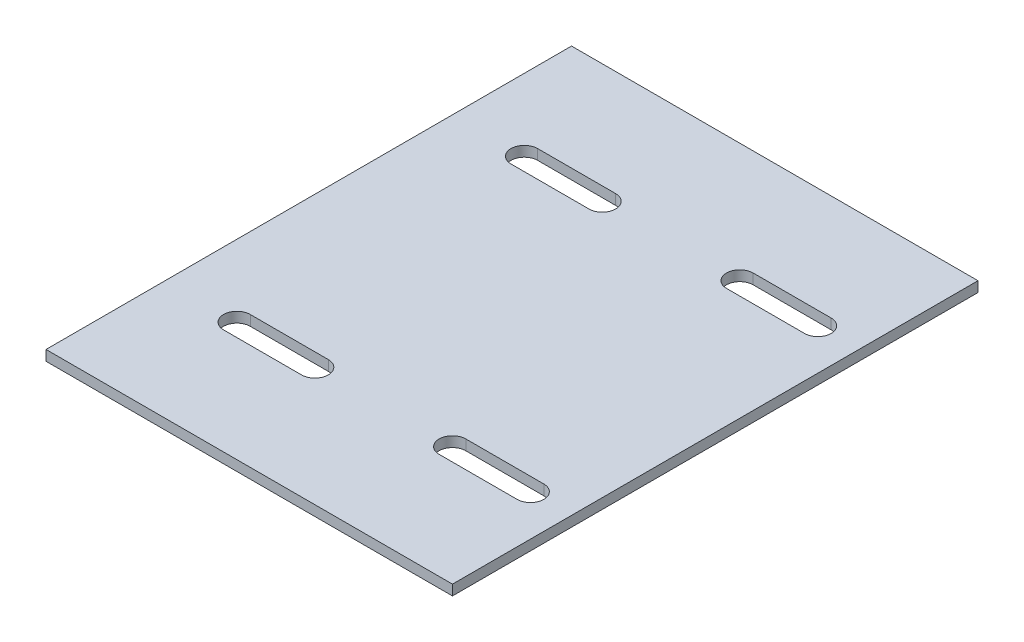
ISO-10303-21;
HEADER;
FILE_DESCRIPTION(('STEP AP214'),'2;1');
FILE_NAME('part.step','',(''),(''),'','','');
FILE_SCHEMA(('AUTOMOTIVE_DESIGN { 1 0 10303 214 1 1 1 1 }'));
ENDSEC;
DATA;
#1=APPLICATION_CONTEXT('core data for automotive mechanical design processes');
#2=APPLICATION_PROTOCOL_DEFINITION('international standard','automotive_design',2000,#1);
#3=PRODUCT_CONTEXT('',#1,'mechanical');
#4=PRODUCT('Part','Part','',(#3));
#5=PRODUCT_RELATED_PRODUCT_CATEGORY('part','',(#4));
#6=PRODUCT_DEFINITION_FORMATION('','',#4);
#7=PRODUCT_DEFINITION_CONTEXT('part definition',#1,'design');
#8=PRODUCT_DEFINITION('design','',#6,#7);
#9=PRODUCT_DEFINITION_SHAPE('','',#8);
#10=(LENGTH_UNIT() NAMED_UNIT(*) SI_UNIT(.MILLI.,.METRE.));
#11=(NAMED_UNIT(*) PLANE_ANGLE_UNIT() SI_UNIT($,.RADIAN.));
#12=(NAMED_UNIT(*) SI_UNIT($,.STERADIAN.) SOLID_ANGLE_UNIT());
#13=UNCERTAINTY_MEASURE_WITH_UNIT(LENGTH_MEASURE(1.E-05),#10,'distance_accuracy_value','');
#14=(GEOMETRIC_REPRESENTATION_CONTEXT(3) GLOBAL_UNCERTAINTY_ASSIGNED_CONTEXT((#13)) GLOBAL_UNIT_ASSIGNED_CONTEXT((#10,
#11,#12)) REPRESENTATION_CONTEXT('',''));
#15=CARTESIAN_POINT('',(0.,0.,0.));
#16=DIRECTION('',(0.,0.,1.));
#17=DIRECTION('',(1.,0.,0.));
#18=AXIS2_PLACEMENT_3D('',#15,#16,#17);
#19=CARTESIAN_POINT('',(-10.,550.,398.5));
#20=DIRECTION('',(0.,0.,-1.));
#21=DIRECTION('',(-1.,0.,0.));
#22=AXIS2_PLACEMENT_3D('',#19,#20,#21);
#23=PLANE('',#22);
#24=DIRECTION('',(1.,0.,0.));
#25=VECTOR('',#24,1.);
#26=CARTESIAN_POINT('',(-10.,545.,398.5));
#27=LINE('',#26,#25);
#28=CARTESIAN_POINT('',(-291.500000000584,545.,398.5));
#29=VERTEX_POINT('',#28);
#30=CARTESIAN_POINT('',(-253.5,545.,398.5));
#31=VERTEX_POINT('',#30);
#32=EDGE_CURVE('E247',#29,#31,#27,.T.);
#33=ORIENTED_EDGE('',*,*,#32,.T.);
#34=DIRECTION('',(0.,-1.,0.));
#35=VECTOR('',#34,1.);
#36=CARTESIAN_POINT('',(-253.5,550.,398.5));
#37=LINE('',#36,#35);
#38=CARTESIAN_POINT('',(-253.5,550.,398.5));
#39=VERTEX_POINT('',#38);
#40=EDGE_CURVE('E11',#39,#31,#37,.T.);
#41=ORIENTED_EDGE('',*,*,#40,.F.);
#42=DIRECTION('',(1.,0.,0.));
#43=VECTOR('',#42,1.);
#44=CARTESIAN_POINT('',(-10.,550.,398.5));
#45=LINE('',#44,#43);
#46=CARTESIAN_POINT('',(-291.500000000584,550.,398.5));
#47=VERTEX_POINT('',#46);
#48=EDGE_CURVE('E188',#47,#39,#45,.T.);
#49=ORIENTED_EDGE('',*,*,#48,.F.);
#50=DIRECTION('',(0.,-1.,0.));
#51=VECTOR('',#50,1.);
#52=CARTESIAN_POINT('',(-291.500000000584,550.,398.5));
#53=LINE('',#52,#51);
#54=EDGE_CURVE('E254',#47,#29,#53,.T.);
#55=ORIENTED_EDGE('',*,*,#54,.T.);
#56=EDGE_LOOP('',(#33,#41,#49,#55));
#57=FACE_BOUND('',#56,.T.);
#58=ADVANCED_FACE('F34',(#57),#23,.F.);
#59=CARTESIAN_POINT('',(-253.5,550.,405.));
#60=DIRECTION('',(0.,-1.,0.));
#61=DIRECTION('',(0.,0.,-1.));
#62=AXIS2_PLACEMENT_3D('',#59,#60,#61);
#63=CYLINDRICAL_SURFACE('',#62,6.50000000000001);
#64=CARTESIAN_POINT('',(-253.5,545.,405.));
#65=DIRECTION('',(0.,1.,0.));
#66=DIRECTION('',(0.,0.,1.));
#67=AXIS2_PLACEMENT_3D('',#64,#65,#66);
#68=CIRCLE('',#67,6.50000000000001);
#69=CARTESIAN_POINT('',(-253.500000001333,545.,411.5));
#70=VERTEX_POINT('',#69);
#71=EDGE_CURVE('E193',#31,#70,#68,.F.);
#72=ORIENTED_EDGE('',*,*,#71,.T.);
#73=DIRECTION('',(0.,-1.,0.));
#74=VECTOR('',#73,1.);
#75=CARTESIAN_POINT('',(-253.500000001333,550.,411.5));
#76=LINE('',#75,#74);
#77=CARTESIAN_POINT('',(-253.500000001333,550.,411.5));
#78=VERTEX_POINT('',#77);
#79=EDGE_CURVE('E44',#78,#70,#76,.T.);
#80=ORIENTED_EDGE('',*,*,#79,.F.);
#81=CARTESIAN_POINT('',(-253.5,550.,405.));
#82=DIRECTION('',(0.,1.,0.));
#83=DIRECTION('',(0.,0.,1.));
#84=AXIS2_PLACEMENT_3D('',#81,#82,#83);
#85=CIRCLE('',#84,6.50000000000001);
#86=EDGE_CURVE('E182',#39,#78,#85,.F.);
#87=ORIENTED_EDGE('',*,*,#86,.F.);
#88=ORIENTED_EDGE('',*,*,#40,.T.);
#89=EDGE_LOOP('',(#72,#80,#87,#88));
#90=FACE_BOUND('',#89,.T.);
#91=ADVANCED_FACE('F192',(#90),#63,.F.);
#92=CARTESIAN_POINT('',(-10.,550.,411.5));
#93=DIRECTION('',(0.,0.,1.));
#94=DIRECTION('',(1.,0.,0.));
#95=AXIS2_PLACEMENT_3D('',#92,#93,#94);
#96=PLANE('',#95);
#97=DIRECTION('',(-1.,0.,0.));
#98=VECTOR('',#97,1.);
#99=CARTESIAN_POINT('',(-10.,545.,411.5));
#100=LINE('',#99,#98);
#101=CARTESIAN_POINT('',(-291.5,545.,411.5));
#102=VERTEX_POINT('',#101);
#103=EDGE_CURVE('E118',#70,#102,#100,.T.);
#104=ORIENTED_EDGE('',*,*,#103,.T.);
#105=DIRECTION('',(0.,-1.,0.));
#106=VECTOR('',#105,1.);
#107=CARTESIAN_POINT('',(-291.5,550.,411.5));
#108=LINE('',#107,#106);
#109=CARTESIAN_POINT('',(-291.5,550.,411.5));
#110=VERTEX_POINT('',#109);
#111=EDGE_CURVE('E194',#110,#102,#108,.T.);
#112=ORIENTED_EDGE('',*,*,#111,.F.);
#113=DIRECTION('',(-1.,0.,0.));
#114=VECTOR('',#113,1.);
#115=CARTESIAN_POINT('',(-10.,550.,411.5));
#116=LINE('',#115,#114);
#117=EDGE_CURVE('E186',#78,#110,#116,.T.);
#118=ORIENTED_EDGE('',*,*,#117,.F.);
#119=ORIENTED_EDGE('',*,*,#79,.T.);
#120=EDGE_LOOP('',(#104,#112,#118,#119));
#121=FACE_BOUND('',#120,.T.);
#122=ADVANCED_FACE('F196',(#121),#96,.F.);
#123=CARTESIAN_POINT('',(-233.5,550.,0.));
#124=DIRECTION('',(1.,0.,0.));
#125=DIRECTION('',(0.,0.,-1.));
#126=AXIS2_PLACEMENT_3D('',#123,#124,#125);
#127=PLANE('',#126);
#128=DIRECTION('',(0.,0.,1.));
#129=VECTOR('',#128,1.);
#130=CARTESIAN_POINT('',(-233.5,545.,0.));
#131=LINE('',#130,#129);
#132=CARTESIAN_POINT('',(-233.5,545.,207.));
#133=VERTEX_POINT('',#132);
#134=CARTESIAN_POINT('',(-233.5,545.,463.));
#135=VERTEX_POINT('',#134);
#136=EDGE_CURVE('E235',#133,#135,#131,.T.);
#137=ORIENTED_EDGE('',*,*,#136,.F.);
#138=DIRECTION('',(0.,-1.,0.));
#139=VECTOR('',#138,1.);
#140=CARTESIAN_POINT('',(-233.5,550.,207.));
#141=LINE('',#140,#139);
#142=CARTESIAN_POINT('',(-233.5,550.,207.));
#143=VERTEX_POINT('',#142);
#144=EDGE_CURVE('E256',#143,#133,#141,.T.);
#145=ORIENTED_EDGE('',*,*,#144,.F.);
#146=DIRECTION('',(0.,0.,1.));
#147=VECTOR('',#146,1.);
#148=CARTESIAN_POINT('',(-233.5,550.,0.));
#149=LINE('',#148,#147);
#150=CARTESIAN_POINT('',(-233.5,550.,463.));
#151=VERTEX_POINT('',#150);
#152=EDGE_CURVE('E337',#143,#151,#149,.T.);
#153=ORIENTED_EDGE('',*,*,#152,.T.);
#154=DIRECTION('',(0.,-1.,0.));
#155=VECTOR('',#154,1.);
#156=CARTESIAN_POINT('',(-233.5,550.,463.));
#157=LINE('',#156,#155);
#158=EDGE_CURVE('E258',#151,#135,#157,.T.);
#159=ORIENTED_EDGE('',*,*,#158,.T.);
#160=EDGE_LOOP('',(#137,#145,#153,#159));
#161=FACE_BOUND('',#160,.T.);
#162=ADVANCED_FACE('F357',(#161),#127,.T.);
#163=CARTESIAN_POINT('',(-10.,550.,207.));
#164=DIRECTION('',(0.,0.,-1.));
#165=DIRECTION('',(-1.,0.,0.));
#166=AXIS2_PLACEMENT_3D('',#163,#164,#165);
#167=PLANE('',#166);
#168=DIRECTION('',(1.,0.,0.));
#169=VECTOR('',#168,1.);
#170=CARTESIAN_POINT('',(-10.,545.,207.));
#171=LINE('',#170,#169);
#172=CARTESIAN_POINT('',(-431.5,545.,207.));
#173=VERTEX_POINT('',#172);
#174=EDGE_CURVE('E238',#173,#133,#171,.T.);
#175=ORIENTED_EDGE('',*,*,#174,.F.);
#176=DIRECTION('',(0.,-1.,0.));
#177=VECTOR('',#176,1.);
#178=CARTESIAN_POINT('',(-431.5,550.,207.));
#179=LINE('',#178,#177);
#180=CARTESIAN_POINT('',(-431.5,550.,207.));
#181=VERTEX_POINT('',#180);
#182=EDGE_CURVE('E264',#181,#173,#179,.T.);
#183=ORIENTED_EDGE('',*,*,#182,.F.);
#184=DIRECTION('',(1.,0.,0.));
#185=VECTOR('',#184,1.);
#186=CARTESIAN_POINT('',(-10.,550.,207.));
#187=LINE('',#186,#185);
#188=EDGE_CURVE('E340',#181,#143,#187,.T.);
#189=ORIENTED_EDGE('',*,*,#188,.T.);
#190=ORIENTED_EDGE('',*,*,#144,.T.);
#191=EDGE_LOOP('',(#175,#183,#189,#190));
#192=FACE_BOUND('',#191,.T.);
#193=ADVANCED_FACE('F360',(#192),#167,.T.);
#194=CARTESIAN_POINT('',(-431.5,550.,0.));
#195=DIRECTION('',(1.,0.,0.));
#196=DIRECTION('',(0.,0.,-1.));
#197=AXIS2_PLACEMENT_3D('',#194,#195,#196);
#198=PLANE('',#197);
#199=DIRECTION('',(0.,0.,1.));
#200=VECTOR('',#199,1.);
#201=CARTESIAN_POINT('',(-431.5,545.,0.));
#202=LINE('',#201,#200);
#203=CARTESIAN_POINT('',(-431.5,545.,463.));
#204=VERTEX_POINT('',#203);
#205=EDGE_CURVE('E241',#173,#204,#202,.T.);
#206=ORIENTED_EDGE('',*,*,#205,.T.);
#207=DIRECTION('',(0.,-1.,0.));
#208=VECTOR('',#207,1.);
#209=CARTESIAN_POINT('',(-431.5,550.,463.));
#210=LINE('',#209,#208);
#211=CARTESIAN_POINT('',(-431.5,550.,463.));
#212=VERTEX_POINT('',#211);
#213=EDGE_CURVE('E260',#212,#204,#210,.T.);
#214=ORIENTED_EDGE('',*,*,#213,.F.);
#215=DIRECTION('',(0.,0.,1.));
#216=VECTOR('',#215,1.);
#217=CARTESIAN_POINT('',(-431.5,550.,0.));
#218=LINE('',#217,#216);
#219=EDGE_CURVE('E343',#181,#212,#218,.T.);
#220=ORIENTED_EDGE('',*,*,#219,.F.);
#221=ORIENTED_EDGE('',*,*,#182,.T.);
#222=EDGE_LOOP('',(#206,#214,#220,#221));
#223=FACE_BOUND('',#222,.T.);
#224=ADVANCED_FACE('F363',(#223),#198,.F.);
#225=CARTESIAN_POINT('',(-358.5,550.,265.));
#226=DIRECTION('',(0.,-1.,0.));
#227=DIRECTION('',(0.,0.,-1.));
#228=AXIS2_PLACEMENT_3D('',#225,#226,#227);
#229=CYLINDRICAL_SURFACE('',#228,6.50000000000001);
#230=CARTESIAN_POINT('',(-358.5,545.,265.));
#231=DIRECTION('',(0.,1.,0.));
#232=DIRECTION('',(0.,0.,1.));
#233=AXIS2_PLACEMENT_3D('',#230,#231,#232);
#234=CIRCLE('',#233,6.50000000000001);
#235=CARTESIAN_POINT('',(-358.5,545.,271.5));
#236=VERTEX_POINT('',#235);
#237=CARTESIAN_POINT('',(-358.500000001231,545.,258.5));
#238=VERTEX_POINT('',#237);
#239=EDGE_CURVE('E223',#236,#238,#234,.T.);
#240=ORIENTED_EDGE('',*,*,#239,.F.);
#241=DIRECTION('',(0.,-1.,0.));
#242=VECTOR('',#241,1.);
#243=CARTESIAN_POINT('',(-358.5,550.,271.5));
#244=LINE('',#243,#242);
#245=CARTESIAN_POINT('',(-358.5,550.,271.5));
#246=VERTEX_POINT('',#245);
#247=EDGE_CURVE('E261',#246,#236,#244,.T.);
#248=ORIENTED_EDGE('',*,*,#247,.F.);
#249=CARTESIAN_POINT('',(-358.5,550.,265.));
#250=DIRECTION('',(0.,1.,0.));
#251=DIRECTION('',(0.,0.,1.));
#252=AXIS2_PLACEMENT_3D('',#249,#250,#251);
#253=CIRCLE('',#252,6.50000000000001);
#254=CARTESIAN_POINT('',(-358.500000001231,550.,258.5));
#255=VERTEX_POINT('',#254);
#256=EDGE_CURVE('E325',#246,#255,#253,.T.);
#257=ORIENTED_EDGE('',*,*,#256,.T.);
#258=DIRECTION('',(0.,-1.,0.));
#259=VECTOR('',#258,1.);
#260=CARTESIAN_POINT('',(-358.500000001231,550.,258.5));
#261=LINE('',#260,#259);
#262=EDGE_CURVE('E267',#255,#238,#261,.T.);
#263=ORIENTED_EDGE('',*,*,#262,.T.);
#264=EDGE_LOOP('',(#240,#248,#257,#263));
#265=FACE_BOUND('',#264,.T.);
#266=ADVANCED_FACE('F393',(#265),#229,.F.);
#267=CARTESIAN_POINT('',(-10.,550.,271.5));
#268=DIRECTION('',(0.,0.,-1.));
#269=DIRECTION('',(-1.,0.,0.));
#270=AXIS2_PLACEMENT_3D('',#267,#268,#269);
#271=PLANE('',#270);
#272=DIRECTION('',(1.,0.,0.));
#273=VECTOR('',#272,1.);
#274=CARTESIAN_POINT('',(-10.,545.,271.5));
#275=LINE('',#274,#273);
#276=CARTESIAN_POINT('',(-396.500000000584,545.,271.5));
#277=VERTEX_POINT('',#276);
#278=EDGE_CURVE('E226',#277,#236,#275,.T.);
#279=ORIENTED_EDGE('',*,*,#278,.F.);
#280=DIRECTION('',(0.,-1.,0.));
#281=VECTOR('',#280,1.);
#282=CARTESIAN_POINT('',(-396.500000000584,550.,271.5));
#283=LINE('',#282,#281);
#284=CARTESIAN_POINT('',(-396.500000000584,550.,271.5));
#285=VERTEX_POINT('',#284);
#286=EDGE_CURVE('E272',#285,#277,#283,.T.);
#287=ORIENTED_EDGE('',*,*,#286,.F.);
#288=DIRECTION('',(1.,0.,0.));
#289=VECTOR('',#288,1.);
#290=CARTESIAN_POINT('',(-10.,550.,271.5));
#291=LINE('',#290,#289);
#292=EDGE_CURVE('E328',#285,#246,#291,.T.);
#293=ORIENTED_EDGE('',*,*,#292,.T.);
#294=ORIENTED_EDGE('',*,*,#247,.T.);
#295=EDGE_LOOP('',(#279,#287,#293,#294));
#296=FACE_BOUND('',#295,.T.);
#297=ADVANCED_FACE('F405',(#296),#271,.T.);
#298=CARTESIAN_POINT('',(-396.5,550.,265.));
#299=DIRECTION('',(0.,-1.,0.));
#300=DIRECTION('',(0.,0.,-1.));
#301=AXIS2_PLACEMENT_3D('',#298,#299,#300);
#302=CYLINDRICAL_SURFACE('',#301,6.50000000000001);
#303=CARTESIAN_POINT('',(-396.5,545.,265.));
#304=DIRECTION('',(0.,1.,0.));
#305=DIRECTION('',(0.,0.,1.));
#306=AXIS2_PLACEMENT_3D('',#303,#304,#305);
#307=CIRCLE('',#306,6.50000000000001);
#308=CARTESIAN_POINT('',(-396.5,545.,258.5));
#309=VERTEX_POINT('',#308);
#310=EDGE_CURVE('E229',#309,#277,#307,.T.);
#311=ORIENTED_EDGE('',*,*,#310,.F.);
#312=DIRECTION('',(0.,-1.,0.));
#313=VECTOR('',#312,1.);
#314=CARTESIAN_POINT('',(-396.5,550.,258.5));
#315=LINE('',#314,#313);
#316=CARTESIAN_POINT('',(-396.5,550.,258.5));
#317=VERTEX_POINT('',#316);
#318=EDGE_CURVE('E269',#317,#309,#315,.T.);
#319=ORIENTED_EDGE('',*,*,#318,.F.);
#320=CARTESIAN_POINT('',(-396.5,550.,265.));
#321=DIRECTION('',(0.,1.,0.));
#322=DIRECTION('',(0.,0.,1.));
#323=AXIS2_PLACEMENT_3D('',#320,#321,#322);
#324=CIRCLE('',#323,6.50000000000001);
#325=EDGE_CURVE('E331',#317,#285,#324,.T.);
#326=ORIENTED_EDGE('',*,*,#325,.T.);
#327=ORIENTED_EDGE('',*,*,#286,.T.);
#328=EDGE_LOOP('',(#311,#319,#326,#327));
#329=FACE_BOUND('',#328,.T.);
#330=ADVANCED_FACE('F401',(#329),#302,.F.);
#331=CARTESIAN_POINT('',(-253.5,550.,265.));
#332=DIRECTION('',(0.,-1.,0.));
#333=DIRECTION('',(0.,0.,-1.));
#334=AXIS2_PLACEMENT_3D('',#331,#332,#333);
#335=CYLINDRICAL_SURFACE('',#334,6.50000000000001);
#336=CARTESIAN_POINT('',(-253.5,545.,265.));
#337=DIRECTION('',(0.,1.,0.));
#338=DIRECTION('',(0.,0.,1.));
#339=AXIS2_PLACEMENT_3D('',#336,#337,#338);
#340=CIRCLE('',#339,6.50000000000001);
#341=CARTESIAN_POINT('',(-253.5,545.,271.5));
#342=VERTEX_POINT('',#341);
#343=CARTESIAN_POINT('',(-253.500000001333,545.,258.5));
#344=VERTEX_POINT('',#343);
#345=EDGE_CURVE('E211',#342,#344,#340,.T.);
#346=ORIENTED_EDGE('',*,*,#345,.F.);
#347=DIRECTION('',(0.,-1.,0.));
#348=VECTOR('',#347,1.);
#349=CARTESIAN_POINT('',(-253.5,550.,271.5));
#350=LINE('',#349,#348);
#351=CARTESIAN_POINT('',(-253.5,550.,271.5));
#352=VERTEX_POINT('',#351);
#353=EDGE_CURVE('E270',#352,#342,#350,.T.);
#354=ORIENTED_EDGE('',*,*,#353,.F.);
#355=CARTESIAN_POINT('',(-253.5,550.,265.));
#356=DIRECTION('',(0.,1.,0.));
#357=DIRECTION('',(0.,0.,1.));
#358=AXIS2_PLACEMENT_3D('',#355,#356,#357);
#359=CIRCLE('',#358,6.50000000000001);
#360=CARTESIAN_POINT('',(-253.500000001333,550.,258.5));
#361=VERTEX_POINT('',#360);
#362=EDGE_CURVE('E308',#352,#361,#359,.T.);
#363=ORIENTED_EDGE('',*,*,#362,.T.);
#364=DIRECTION('',(0.,-1.,0.));
#365=VECTOR('',#364,1.);
#366=CARTESIAN_POINT('',(-253.500000001333,550.,258.5));
#367=LINE('',#366,#365);
#368=EDGE_CURVE('E275',#361,#344,#367,.T.);
#369=ORIENTED_EDGE('',*,*,#368,.T.);
#370=EDGE_LOOP('',(#346,#354,#363,#369));
#371=FACE_BOUND('',#370,.T.);
#372=ADVANCED_FACE('F404',(#371),#335,.F.);
#373=CARTESIAN_POINT('',(-10.,550.,271.5));
#374=DIRECTION('',(0.,0.,-1.));
#375=DIRECTION('',(-1.,0.,0.));
#376=AXIS2_PLACEMENT_3D('',#373,#374,#375);
#377=PLANE('',#376);
#378=DIRECTION('',(1.,0.,0.));
#379=VECTOR('',#378,1.);
#380=CARTESIAN_POINT('',(-10.,545.,271.5));
#381=LINE('',#380,#379);
#382=CARTESIAN_POINT('',(-291.500000000584,545.,271.5));
#383=VERTEX_POINT('',#382);
#384=EDGE_CURVE('E214',#383,#342,#381,.T.);
#385=ORIENTED_EDGE('',*,*,#384,.F.);
#386=DIRECTION('',(0.,-1.,0.));
#387=VECTOR('',#386,1.);
#388=CARTESIAN_POINT('',(-291.500000000584,550.,271.5));
#389=LINE('',#388,#387);
#390=CARTESIAN_POINT('',(-291.500000000584,550.,271.5));
#391=VERTEX_POINT('',#390);
#392=EDGE_CURVE('E279',#391,#383,#389,.T.);
#393=ORIENTED_EDGE('',*,*,#392,.F.);
#394=DIRECTION('',(1.,0.,0.));
#395=VECTOR('',#394,1.);
#396=CARTESIAN_POINT('',(-10.,550.,271.5));
#397=LINE('',#396,#395);
#398=EDGE_CURVE('E312',#391,#352,#397,.T.);
#399=ORIENTED_EDGE('',*,*,#398,.T.);
#400=ORIENTED_EDGE('',*,*,#353,.T.);
#401=EDGE_LOOP('',(#385,#393,#399,#400));
#402=FACE_BOUND('',#401,.T.);
#403=ADVANCED_FACE('F419',(#402),#377,.T.);
#404=CARTESIAN_POINT('',(-291.5,550.,265.));
#405=DIRECTION('',(0.,-1.,0.));
#406=DIRECTION('',(0.,0.,-1.));
#407=AXIS2_PLACEMENT_3D('',#404,#405,#406);
#408=CYLINDRICAL_SURFACE('',#407,6.50000000000001);
#409=CARTESIAN_POINT('',(-291.5,545.,265.));
#410=DIRECTION('',(0.,1.,0.));
#411=DIRECTION('',(0.,0.,1.));
#412=AXIS2_PLACEMENT_3D('',#409,#410,#411);
#413=CIRCLE('',#412,6.50000000000001);
#414=CARTESIAN_POINT('',(-291.5,545.,258.5));
#415=VERTEX_POINT('',#414);
#416=EDGE_CURVE('E217',#415,#383,#413,.T.);
#417=ORIENTED_EDGE('',*,*,#416,.F.);
#418=DIRECTION('',(0.,-1.,0.));
#419=VECTOR('',#418,1.);
#420=CARTESIAN_POINT('',(-291.5,550.,258.5));
#421=LINE('',#420,#419);
#422=CARTESIAN_POINT('',(-291.5,550.,258.5));
#423=VERTEX_POINT('',#422);
#424=EDGE_CURVE('E277',#423,#415,#421,.T.);
#425=ORIENTED_EDGE('',*,*,#424,.F.);
#426=CARTESIAN_POINT('',(-291.5,550.,265.));
#427=DIRECTION('',(0.,1.,0.));
#428=DIRECTION('',(0.,0.,1.));
#429=AXIS2_PLACEMENT_3D('',#426,#427,#428);
#430=CIRCLE('',#429,6.50000000000001);
#431=EDGE_CURVE('E319',#423,#391,#430,.T.);
#432=ORIENTED_EDGE('',*,*,#431,.T.);
#433=ORIENTED_EDGE('',*,*,#392,.T.);
#434=EDGE_LOOP('',(#417,#425,#432,#433));
#435=FACE_BOUND('',#434,.T.);
#436=ADVANCED_FACE('F416',(#435),#408,.F.);
#437=CARTESIAN_POINT('',(-10.,550.,411.5));
#438=DIRECTION('',(0.,0.,1.));
#439=DIRECTION('',(1.,0.,0.));
#440=AXIS2_PLACEMENT_3D('',#437,#438,#439);
#441=PLANE('',#440);
#442=DIRECTION('',(-1.,0.,0.));
#443=VECTOR('',#442,1.);
#444=CARTESIAN_POINT('',(-10.,545.,411.5));
#445=LINE('',#444,#443);
#446=CARTESIAN_POINT('',(-358.500000001333,545.,411.5));
#447=VERTEX_POINT('',#446);
#448=CARTESIAN_POINT('',(-396.5,545.,411.5));
#449=VERTEX_POINT('',#448);
#450=EDGE_CURVE('E202',#447,#449,#445,.T.);
#451=ORIENTED_EDGE('',*,*,#450,.T.);
#452=DIRECTION('',(0.,-1.,0.));
#453=VECTOR('',#452,1.);
#454=CARTESIAN_POINT('',(-396.5,550.,411.5));
#455=LINE('',#454,#453);
#456=CARTESIAN_POINT('',(-396.5,550.,411.5));
#457=VERTEX_POINT('',#456);
#458=EDGE_CURVE('E38',#457,#449,#455,.T.);
#459=ORIENTED_EDGE('',*,*,#458,.F.);
#460=DIRECTION('',(-1.,0.,0.));
#461=VECTOR('',#460,1.);
#462=CARTESIAN_POINT('',(-10.,550.,411.5));
#463=LINE('',#462,#461);
#464=CARTESIAN_POINT('',(-358.500000001333,550.,411.5));
#465=VERTEX_POINT('',#464);
#466=EDGE_CURVE('E253',#465,#457,#463,.T.);
#467=ORIENTED_EDGE('',*,*,#466,.F.);
#468=DIRECTION('',(0.,-1.,0.));
#469=VECTOR('',#468,1.);
#470=CARTESIAN_POINT('',(-358.500000001333,550.,411.5));
#471=LINE('',#470,#469);
#472=EDGE_CURVE('E198',#465,#447,#471,.T.);
#473=ORIENTED_EDGE('',*,*,#472,.T.);
#474=EDGE_LOOP('',(#451,#459,#467,#473));
#475=FACE_BOUND('',#474,.T.);
#476=ADVANCED_FACE('F36',(#475),#441,.F.);
#477=CARTESIAN_POINT('',(-396.5,550.,405.));
#478=DIRECTION('',(0.,-1.,0.));
#479=DIRECTION('',(0.,0.,-1.));
#480=AXIS2_PLACEMENT_3D('',#477,#478,#479);
#481=CYLINDRICAL_SURFACE('',#480,6.50000000000001);
#482=CARTESIAN_POINT('',(-396.5,545.,405.));
#483=DIRECTION('',(0.,1.,0.));
#484=DIRECTION('',(0.,0.,1.));
#485=AXIS2_PLACEMENT_3D('',#482,#483,#484);
#486=CIRCLE('',#485,6.50000000000001);
#487=CARTESIAN_POINT('',(-396.500000000584,545.,398.5));
#488=VERTEX_POINT('',#487);
#489=EDGE_CURVE('E205',#449,#488,#486,.F.);
#490=ORIENTED_EDGE('',*,*,#489,.T.);
#491=DIRECTION('',(0.,-1.,0.));
#492=VECTOR('',#491,1.);
#493=CARTESIAN_POINT('',(-396.500000000584,550.,398.5));
#494=LINE('',#493,#492);
#495=CARTESIAN_POINT('',(-396.500000000584,550.,398.5));
#496=VERTEX_POINT('',#495);
#497=EDGE_CURVE('E286',#496,#488,#494,.T.);
#498=ORIENTED_EDGE('',*,*,#497,.F.);
#499=CARTESIAN_POINT('',(-396.5,550.,405.));
#500=DIRECTION('',(0.,1.,0.));
#501=DIRECTION('',(0.,0.,1.));
#502=AXIS2_PLACEMENT_3D('',#499,#500,#501);
#503=CIRCLE('',#502,6.50000000000001);
#504=EDGE_CURVE('E133',#457,#496,#503,.F.);
#505=ORIENTED_EDGE('',*,*,#504,.F.);
#506=ORIENTED_EDGE('',*,*,#458,.T.);
#507=EDGE_LOOP('',(#490,#498,#505,#506));
#508=FACE_BOUND('',#507,.T.);
#509=ADVANCED_FACE('F292',(#508),#481,.F.);
#510=CARTESIAN_POINT('',(-10.,550.,398.5));
#511=DIRECTION('',(0.,0.,-1.));
#512=DIRECTION('',(-1.,0.,0.));
#513=AXIS2_PLACEMENT_3D('',#510,#511,#512);
#514=PLANE('',#513);
#515=DIRECTION('',(1.,0.,0.));
#516=VECTOR('',#515,1.);
#517=CARTESIAN_POINT('',(-10.,545.,398.5));
#518=LINE('',#517,#516);
#519=CARTESIAN_POINT('',(-358.5,545.,398.5));
#520=VERTEX_POINT('',#519);
#521=EDGE_CURVE('E207',#488,#520,#518,.T.);
#522=ORIENTED_EDGE('',*,*,#521,.T.);
#523=DIRECTION('',(0.,-1.,0.));
#524=VECTOR('',#523,1.);
#525=CARTESIAN_POINT('',(-358.5,550.,398.5));
#526=LINE('',#525,#524);
#527=CARTESIAN_POINT('',(-358.5,550.,398.5));
#528=VERTEX_POINT('',#527);
#529=EDGE_CURVE('E284',#528,#520,#526,.T.);
#530=ORIENTED_EDGE('',*,*,#529,.F.);
#531=DIRECTION('',(1.,0.,0.));
#532=VECTOR('',#531,1.);
#533=CARTESIAN_POINT('',(-10.,550.,398.5));
#534=LINE('',#533,#532);
#535=EDGE_CURVE('E309',#496,#528,#534,.T.);
#536=ORIENTED_EDGE('',*,*,#535,.F.);
#537=ORIENTED_EDGE('',*,*,#497,.T.);
#538=EDGE_LOOP('',(#522,#530,#536,#537));
#539=FACE_BOUND('',#538,.T.);
#540=ADVANCED_FACE('F302',(#539),#514,.F.);
#541=CARTESIAN_POINT('',(-10.,550.,463.));
#542=DIRECTION('',(0.,0.,-1.));
#543=DIRECTION('',(-1.,0.,0.));
#544=AXIS2_PLACEMENT_3D('',#541,#542,#543);
#545=PLANE('',#544);
#546=DIRECTION('',(1.,0.,0.));
#547=VECTOR('',#546,1.);
#548=CARTESIAN_POINT('',(-10.,545.,463.));
#549=LINE('',#548,#547);
#550=EDGE_CURVE('E244',#204,#135,#549,.T.);
#551=ORIENTED_EDGE('',*,*,#550,.T.);
#552=ORIENTED_EDGE('',*,*,#158,.F.);
#553=DIRECTION('',(1.,0.,0.));
#554=VECTOR('',#553,1.);
#555=CARTESIAN_POINT('',(-10.,550.,463.));
#556=LINE('',#555,#554);
#557=EDGE_CURVE('E346',#212,#151,#556,.T.);
#558=ORIENTED_EDGE('',*,*,#557,.F.);
#559=ORIENTED_EDGE('',*,*,#213,.T.);
#560=EDGE_LOOP('',(#551,#552,#558,#559));
#561=FACE_BOUND('',#560,.T.);
#562=ADVANCED_FACE('F354',(#561),#545,.F.);
#563=CARTESIAN_POINT('',(-10.,550.,258.5));
#564=DIRECTION('',(0.,0.,1.));
#565=DIRECTION('',(1.,0.,0.));
#566=AXIS2_PLACEMENT_3D('',#563,#564,#565);
#567=PLANE('',#566);
#568=DIRECTION('',(-1.,0.,0.));
#569=VECTOR('',#568,1.);
#570=CARTESIAN_POINT('',(-10.,545.,258.5));
#571=LINE('',#570,#569);
#572=EDGE_CURVE('E232',#238,#309,#571,.T.);
#573=ORIENTED_EDGE('',*,*,#572,.F.);
#574=ORIENTED_EDGE('',*,*,#262,.F.);
#575=DIRECTION('',(-1.,0.,0.));
#576=VECTOR('',#575,1.);
#577=CARTESIAN_POINT('',(-10.,550.,258.5));
#578=LINE('',#577,#576);
#579=EDGE_CURVE('E334',#255,#317,#578,.T.);
#580=ORIENTED_EDGE('',*,*,#579,.T.);
#581=ORIENTED_EDGE('',*,*,#318,.T.);
#582=EDGE_LOOP('',(#573,#574,#580,#581));
#583=FACE_BOUND('',#582,.T.);
#584=ADVANCED_FACE('F390',(#583),#567,.T.);
#585=CARTESIAN_POINT('',(-10.,550.,258.5));
#586=DIRECTION('',(0.,0.,1.));
#587=DIRECTION('',(1.,0.,0.));
#588=AXIS2_PLACEMENT_3D('',#585,#586,#587);
#589=PLANE('',#588);
#590=DIRECTION('',(-1.,0.,0.));
#591=VECTOR('',#590,1.);
#592=CARTESIAN_POINT('',(-10.,545.,258.5));
#593=LINE('',#592,#591);
#594=EDGE_CURVE('E220',#344,#415,#593,.T.);
#595=ORIENTED_EDGE('',*,*,#594,.F.);
#596=ORIENTED_EDGE('',*,*,#368,.F.);
#597=DIRECTION('',(-1.,0.,0.));
#598=VECTOR('',#597,1.);
#599=CARTESIAN_POINT('',(-10.,550.,258.5));
#600=LINE('',#599,#598);
#601=EDGE_CURVE('E322',#361,#423,#600,.T.);
#602=ORIENTED_EDGE('',*,*,#601,.T.);
#603=ORIENTED_EDGE('',*,*,#424,.T.);
#604=EDGE_LOOP('',(#595,#596,#602,#603));
#605=FACE_BOUND('',#604,.T.);
#606=ADVANCED_FACE('F378',(#605),#589,.T.);
#607=CARTESIAN_POINT('',(-358.5,550.,405.));
#608=DIRECTION('',(0.,-1.,0.));
#609=DIRECTION('',(0.,0.,-1.));
#610=AXIS2_PLACEMENT_3D('',#607,#608,#609);
#611=CYLINDRICAL_SURFACE('',#610,6.50000000000001);
#612=CARTESIAN_POINT('',(-358.5,545.,405.));
#613=DIRECTION('',(0.,1.,0.));
#614=DIRECTION('',(0.,0.,1.));
#615=AXIS2_PLACEMENT_3D('',#612,#613,#614);
#616=CIRCLE('',#615,6.50000000000001);
#617=EDGE_CURVE('E209',#520,#447,#616,.F.);
#618=ORIENTED_EDGE('',*,*,#617,.T.);
#619=ORIENTED_EDGE('',*,*,#472,.F.);
#620=CARTESIAN_POINT('',(-358.5,550.,405.));
#621=DIRECTION('',(0.,1.,0.));
#622=DIRECTION('',(0.,0.,1.));
#623=AXIS2_PLACEMENT_3D('',#620,#621,#622);
#624=CIRCLE('',#623,6.50000000000001);
#625=EDGE_CURVE('E306',#528,#465,#624,.F.);
#626=ORIENTED_EDGE('',*,*,#625,.F.);
#627=ORIENTED_EDGE('',*,*,#529,.T.);
#628=EDGE_LOOP('',(#618,#619,#626,#627));
#629=FACE_BOUND('',#628,.T.);
#630=ADVANCED_FACE('F305',(#629),#611,.F.);
#631=CARTESIAN_POINT('',(-291.5,550.,405.));
#632=DIRECTION('',(0.,-1.,0.));
#633=DIRECTION('',(0.,0.,-1.));
#634=AXIS2_PLACEMENT_3D('',#631,#632,#633);
#635=CYLINDRICAL_SURFACE('',#634,6.50000000000001);
#636=CARTESIAN_POINT('',(-291.5,545.,405.));
#637=DIRECTION('',(0.,1.,0.));
#638=DIRECTION('',(0.,0.,1.));
#639=AXIS2_PLACEMENT_3D('',#636,#637,#638);
#640=CIRCLE('',#639,6.50000000000001);
#641=EDGE_CURVE('E124',#102,#29,#640,.F.);
#642=ORIENTED_EDGE('',*,*,#641,.T.);
#643=ORIENTED_EDGE('',*,*,#54,.F.);
#644=CARTESIAN_POINT('',(-291.5,550.,405.));
#645=DIRECTION('',(0.,1.,0.));
#646=DIRECTION('',(0.,0.,1.));
#647=AXIS2_PLACEMENT_3D('',#644,#645,#646);
#648=CIRCLE('',#647,6.50000000000001);
#649=EDGE_CURVE('E53',#110,#47,#648,.F.);
#650=ORIENTED_EDGE('',*,*,#649,.F.);
#651=ORIENTED_EDGE('',*,*,#111,.T.);
#652=EDGE_LOOP('',(#642,#643,#650,#651));
#653=FACE_BOUND('',#652,.T.);
#654=ADVANCED_FACE('F370',(#653),#635,.F.);
#655=CARTESIAN_POINT('',(-10.,550.,0.));
#656=DIRECTION('',(0.,1.,0.));
#657=DIRECTION('',(0.,0.,1.));
#658=AXIS2_PLACEMENT_3D('',#655,#656,#657);
#659=PLANE('',#658);
#660=ORIENTED_EDGE('',*,*,#466,.T.);
#661=ORIENTED_EDGE('',*,*,#504,.T.);
#662=ORIENTED_EDGE('',*,*,#535,.T.);
#663=ORIENTED_EDGE('',*,*,#625,.T.);
#664=EDGE_LOOP('',(#660,#661,#662,#663));
#665=FACE_BOUND('',#664,.T.);
#666=ORIENTED_EDGE('',*,*,#362,.F.);
#667=ORIENTED_EDGE('',*,*,#398,.F.);
#668=ORIENTED_EDGE('',*,*,#431,.F.);
#669=ORIENTED_EDGE('',*,*,#601,.F.);
#670=EDGE_LOOP('',(#666,#667,#668,#669));
#671=FACE_BOUND('',#670,.T.);
#672=ORIENTED_EDGE('',*,*,#256,.F.);
#673=ORIENTED_EDGE('',*,*,#292,.F.);
#674=ORIENTED_EDGE('',*,*,#325,.F.);
#675=ORIENTED_EDGE('',*,*,#579,.F.);
#676=EDGE_LOOP('',(#672,#673,#674,#675));
#677=FACE_BOUND('',#676,.T.);
#678=ORIENTED_EDGE('',*,*,#152,.F.);
#679=ORIENTED_EDGE('',*,*,#188,.F.);
#680=ORIENTED_EDGE('',*,*,#219,.T.);
#681=ORIENTED_EDGE('',*,*,#557,.T.);
#682=EDGE_LOOP('',(#678,#679,#680,#681));
#683=FACE_BOUND('',#682,.T.);
#684=ORIENTED_EDGE('',*,*,#48,.T.);
#685=ORIENTED_EDGE('',*,*,#86,.T.);
#686=ORIENTED_EDGE('',*,*,#117,.T.);
#687=ORIENTED_EDGE('',*,*,#649,.T.);
#688=EDGE_LOOP('',(#684,#685,#686,#687));
#689=FACE_BOUND('',#688,.T.);
#690=ADVANCED_FACE('F184',(#665,#671,#677,#683,#689),#659,.T.);
#691=CARTESIAN_POINT('',(-10.,545.,0.));
#692=DIRECTION('',(0.,1.,0.));
#693=DIRECTION('',(0.,0.,1.));
#694=AXIS2_PLACEMENT_3D('',#691,#692,#693);
#695=PLANE('',#694);
#696=ORIENTED_EDGE('',*,*,#450,.F.);
#697=ORIENTED_EDGE('',*,*,#617,.F.);
#698=ORIENTED_EDGE('',*,*,#521,.F.);
#699=ORIENTED_EDGE('',*,*,#489,.F.);
#700=EDGE_LOOP('',(#696,#697,#698,#699));
#701=FACE_BOUND('',#700,.T.);
#702=ORIENTED_EDGE('',*,*,#345,.T.);
#703=ORIENTED_EDGE('',*,*,#594,.T.);
#704=ORIENTED_EDGE('',*,*,#416,.T.);
#705=ORIENTED_EDGE('',*,*,#384,.T.);
#706=EDGE_LOOP('',(#702,#703,#704,#705));
#707=FACE_BOUND('',#706,.T.);
#708=ORIENTED_EDGE('',*,*,#239,.T.);
#709=ORIENTED_EDGE('',*,*,#572,.T.);
#710=ORIENTED_EDGE('',*,*,#310,.T.);
#711=ORIENTED_EDGE('',*,*,#278,.T.);
#712=EDGE_LOOP('',(#708,#709,#710,#711));
#713=FACE_BOUND('',#712,.T.);
#714=ORIENTED_EDGE('',*,*,#136,.T.);
#715=ORIENTED_EDGE('',*,*,#550,.F.);
#716=ORIENTED_EDGE('',*,*,#205,.F.);
#717=ORIENTED_EDGE('',*,*,#174,.T.);
#718=EDGE_LOOP('',(#714,#715,#716,#717));
#719=FACE_BOUND('',#718,.T.);
#720=ORIENTED_EDGE('',*,*,#32,.F.);
#721=ORIENTED_EDGE('',*,*,#641,.F.);
#722=ORIENTED_EDGE('',*,*,#103,.F.);
#723=ORIENTED_EDGE('',*,*,#71,.F.);
#724=EDGE_LOOP('',(#720,#721,#722,#723));
#725=FACE_BOUND('',#724,.T.);
#726=ADVANCED_FACE('F299',(#701,#707,#713,#719,#725),#695,.F.);
#727=CLOSED_SHELL('',(#58,#91,#122,#162,#193,#224,#266,#297,#330,#372,#403,#436,#476,#509,#540,
#562,#584,#606,#630,#654,#690,#726));
#728=MANIFOLD_SOLID_BREP('B2',#727);
#729=ADVANCED_BREP_SHAPE_REPRESENTATION('',(#18,#728),#14);
#730=SHAPE_DEFINITION_REPRESENTATION(#9,#729);
ENDSEC;
END-ISO-10303-21;
